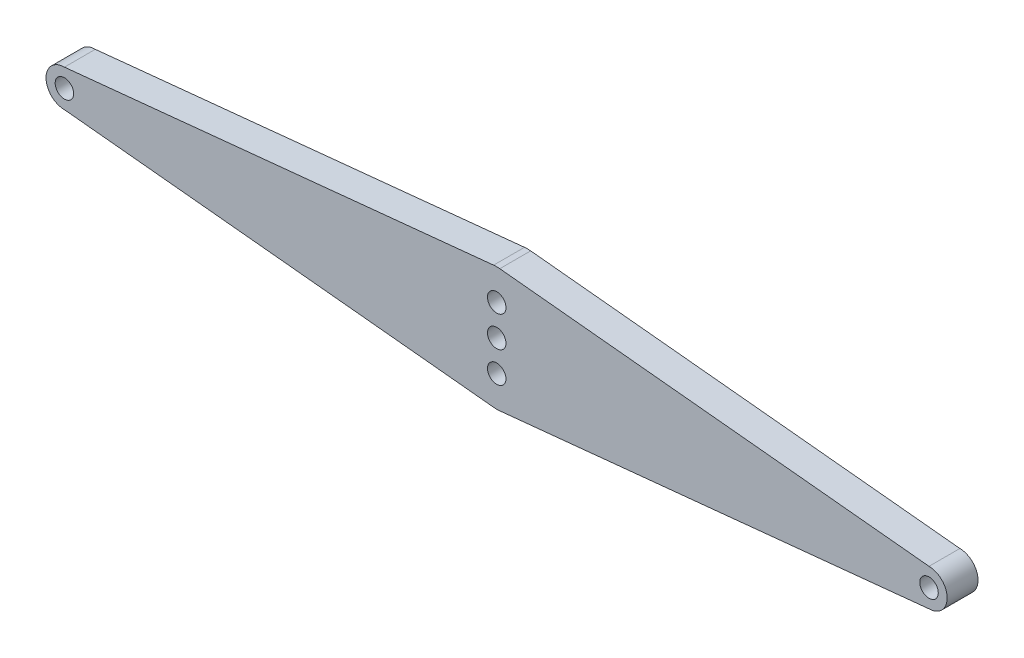
ISO-10303-21;
HEADER;
FILE_DESCRIPTION(('STEP AP214'),'2;1');
FILE_NAME('part.step','',(''),(''),'','','');
FILE_SCHEMA(('AUTOMOTIVE_DESIGN { 1 0 10303 214 1 1 1 1 }'));
ENDSEC;
DATA;
#1=APPLICATION_CONTEXT('core data for automotive mechanical design processes');
#2=APPLICATION_PROTOCOL_DEFINITION('international standard','automotive_design',2000,#1);
#3=PRODUCT_CONTEXT('',#1,'mechanical');
#4=PRODUCT('Part','Part','',(#3));
#5=PRODUCT_RELATED_PRODUCT_CATEGORY('part','',(#4));
#6=PRODUCT_DEFINITION_FORMATION('','',#4);
#7=PRODUCT_DEFINITION_CONTEXT('part definition',#1,'design');
#8=PRODUCT_DEFINITION('design','',#6,#7);
#9=PRODUCT_DEFINITION_SHAPE('','',#8);
#10=(LENGTH_UNIT() NAMED_UNIT(*) SI_UNIT(.MILLI.,.METRE.));
#11=(NAMED_UNIT(*) PLANE_ANGLE_UNIT() SI_UNIT($,.RADIAN.));
#12=(NAMED_UNIT(*) SI_UNIT($,.STERADIAN.) SOLID_ANGLE_UNIT());
#13=UNCERTAINTY_MEASURE_WITH_UNIT(LENGTH_MEASURE(1.E-05),#10,'distance_accuracy_value','');
#14=(GEOMETRIC_REPRESENTATION_CONTEXT(3) GLOBAL_UNCERTAINTY_ASSIGNED_CONTEXT((#13)) GLOBAL_UNIT_ASSIGNED_CONTEXT((#10,
#11,#12)) REPRESENTATION_CONTEXT('',''));
#15=CARTESIAN_POINT('',(0.,0.,0.));
#16=DIRECTION('',(0.,0.,1.));
#17=DIRECTION('',(1.,0.,0.));
#18=AXIS2_PLACEMENT_3D('',#15,#16,#17);
#19=CARTESIAN_POINT('',(0.199516414921997,-1.9849847617036,1.));
#20=DIRECTION('',(0.100008902661797,-0.994986542315213,0.));
#21=DIRECTION('',(0.994986542315213,0.100008902661797,0.));
#22=AXIS2_PLACEMENT_3D('',#19,#20,#21);
#23=PLANE('',#22);
#24=DIRECTION('',(-0.994986542315213,-0.100008902661797,0.));
#25=VECTOR('',#24,1.);
#26=CARTESIAN_POINT('',(0.199516414921997,-1.9849847617036,0.));
#27=LINE('',#26,#25);
#28=CARTESIAN_POINT('',(14.0067831952704,-0.597177449005422,0.));
#29=VERTEX_POINT('',#28);
#30=CARTESIAN_POINT('',(0.100008902661797,-1.99498654231521,0.));
#31=VERTEX_POINT('',#30);
#32=EDGE_CURVE('E146',#29,#31,#27,.T.);
#33=ORIENTED_EDGE('',*,*,#32,.F.);
#34=DIRECTION('',(0.,0.,-1.));
#35=VECTOR('',#34,1.);
#36=CARTESIAN_POINT('',(14.0067831952704,-0.597177449005422,1.));
#37=LINE('',#36,#35);
#38=CARTESIAN_POINT('',(14.0067831952704,-0.597177449005422,1.));
#39=VERTEX_POINT('',#38);
#40=EDGE_CURVE('E11',#39,#29,#37,.T.);
#41=ORIENTED_EDGE('',*,*,#40,.F.);
#42=DIRECTION('',(-0.994986542315213,-0.100008902661797,0.));
#43=VECTOR('',#42,1.);
#44=CARTESIAN_POINT('',(0.199516414921997,-1.9849847617036,1.));
#45=LINE('',#44,#43);
#46=CARTESIAN_POINT('',(0.100008902661797,-1.99498654231521,1.));
#47=VERTEX_POINT('',#46);
#48=EDGE_CURVE('E178',#39,#47,#45,.T.);
#49=ORIENTED_EDGE('',*,*,#48,.T.);
#50=DIRECTION('',(0.,0.,-1.));
#51=VECTOR('',#50,1.);
#52=CARTESIAN_POINT('',(0.100008902661797,-1.99498654231521,1.));
#53=LINE('',#52,#51);
#54=EDGE_CURVE('E89',#47,#31,#53,.T.);
#55=ORIENTED_EDGE('',*,*,#54,.T.);
#56=EDGE_LOOP('',(#33,#41,#49,#55));
#57=FACE_BOUND('',#56,.T.);
#58=ADVANCED_FACE('F38',(#57),#23,.T.);
#59=CARTESIAN_POINT('',(13.9979268814894,0.,1.));
#60=DIRECTION('',(0.,0.,-1.));
#61=DIRECTION('',(-1.,0.,0.));
#62=AXIS2_PLACEMENT_3D('',#59,#60,#61);
#63=CYLINDRICAL_SURFACE('',#62,0.597243116238617);
#64=CARTESIAN_POINT('',(13.9979268814894,0.,0.));
#65=DIRECTION('',(0.,0.,1.));
#66=DIRECTION('',(1.,0.,0.));
#67=AXIS2_PLACEMENT_3D('',#64,#65,#66);
#68=CIRCLE('',#67,0.597243116238617);
#69=CARTESIAN_POINT('',(14.0067831952704,0.597177449005422,0.));
#70=VERTEX_POINT('',#69);
#71=EDGE_CURVE('E149',#29,#70,#68,.T.);
#72=ORIENTED_EDGE('',*,*,#71,.T.);
#73=DIRECTION('',(0.,0.,-1.));
#74=VECTOR('',#73,1.);
#75=CARTESIAN_POINT('',(14.0067831952704,0.597177449005422,1.));
#76=LINE('',#75,#74);
#77=CARTESIAN_POINT('',(14.0067831952704,0.597177449005422,1.));
#78=VERTEX_POINT('',#77);
#79=EDGE_CURVE('E46',#78,#70,#76,.T.);
#80=ORIENTED_EDGE('',*,*,#79,.F.);
#81=CARTESIAN_POINT('',(13.9979268814894,0.,1.));
#82=DIRECTION('',(0.,0.,1.));
#83=DIRECTION('',(1.,0.,0.));
#84=AXIS2_PLACEMENT_3D('',#81,#82,#83);
#85=CIRCLE('',#84,0.597243116238617);
#86=EDGE_CURVE('E207',#39,#78,#85,.T.);
#87=ORIENTED_EDGE('',*,*,#86,.F.);
#88=ORIENTED_EDGE('',*,*,#40,.T.);
#89=EDGE_LOOP('',(#72,#80,#87,#88));
#90=FACE_BOUND('',#89,.T.);
#91=ADVANCED_FACE('F211',(#90),#63,.T.);
#92=CARTESIAN_POINT('',(0.199516414921997,1.9849847617036,1.));
#93=DIRECTION('',(-0.100008902661797,-0.994986542315213,0.));
#94=DIRECTION('',(0.994986542315213,-0.100008902661797,0.));
#95=AXIS2_PLACEMENT_3D('',#92,#93,#94);
#96=PLANE('',#95);
#97=DIRECTION('',(-0.994986542315213,0.100008902661797,0.));
#98=VECTOR('',#97,1.);
#99=CARTESIAN_POINT('',(0.199516414921997,1.9849847617036,0.));
#100=LINE('',#99,#98);
#101=CARTESIAN_POINT('',(0.100008902661797,1.99498654231521,0.));
#102=VERTEX_POINT('',#101);
#103=EDGE_CURVE('E151',#70,#102,#100,.T.);
#104=ORIENTED_EDGE('',*,*,#103,.T.);
#105=DIRECTION('',(0.,0.,-1.));
#106=VECTOR('',#105,1.);
#107=CARTESIAN_POINT('',(0.100008902661797,1.99498654231521,1.));
#108=LINE('',#107,#106);
#109=CARTESIAN_POINT('',(0.100008902661797,1.99498654231521,1.));
#110=VERTEX_POINT('',#109);
#111=EDGE_CURVE('E184',#110,#102,#108,.T.);
#112=ORIENTED_EDGE('',*,*,#111,.F.);
#113=DIRECTION('',(-0.994986542315213,0.100008902661797,0.));
#114=VECTOR('',#113,1.);
#115=CARTESIAN_POINT('',(0.199516414921997,1.9849847617036,1.));
#116=LINE('',#115,#114);
#117=EDGE_CURVE('E193',#78,#110,#116,.T.);
#118=ORIENTED_EDGE('',*,*,#117,.F.);
#119=ORIENTED_EDGE('',*,*,#79,.T.);
#120=EDGE_LOOP('',(#104,#112,#118,#119));
#121=FACE_BOUND('',#120,.T.);
#122=ADVANCED_FACE('F191',(#121),#96,.F.);
#123=CARTESIAN_POINT('',(0.,1.,1.));
#124=DIRECTION('',(0.,0.,-1.));
#125=DIRECTION('',(-1.,0.,0.));
#126=AXIS2_PLACEMENT_3D('',#123,#124,#125);
#127=CYLINDRICAL_SURFACE('',#126,1.);
#128=CARTESIAN_POINT('',(0.,1.,0.));
#129=DIRECTION('',(0.,0.,1.));
#130=DIRECTION('',(1.,0.,0.));
#131=AXIS2_PLACEMENT_3D('',#128,#129,#130);
#132=CIRCLE('',#131,1.);
#133=CARTESIAN_POINT('',(-0.100008902661797,1.99498654231521,0.));
#134=VERTEX_POINT('',#133);
#135=EDGE_CURVE('E153',#102,#134,#132,.T.);
#136=ORIENTED_EDGE('',*,*,#135,.T.);
#137=DIRECTION('',(0.,0.,-1.));
#138=VECTOR('',#137,1.);
#139=CARTESIAN_POINT('',(-0.100008902661797,1.99498654231521,1.));
#140=LINE('',#139,#138);
#141=CARTESIAN_POINT('',(-0.100008902661797,1.99498654231521,1.));
#142=VERTEX_POINT('',#141);
#143=EDGE_CURVE('E182',#142,#134,#140,.T.);
#144=ORIENTED_EDGE('',*,*,#143,.F.);
#145=CARTESIAN_POINT('',(0.,1.,1.));
#146=DIRECTION('',(0.,0.,1.));
#147=DIRECTION('',(1.,0.,0.));
#148=AXIS2_PLACEMENT_3D('',#145,#146,#147);
#149=CIRCLE('',#148,1.);
#150=EDGE_CURVE('E205',#110,#142,#149,.T.);
#151=ORIENTED_EDGE('',*,*,#150,.F.);
#152=ORIENTED_EDGE('',*,*,#111,.T.);
#153=EDGE_LOOP('',(#136,#144,#151,#152));
#154=FACE_BOUND('',#153,.T.);
#155=ADVANCED_FACE('F203',(#154),#127,.T.);
#156=CARTESIAN_POINT('',(-0.199516414921997,1.9849847617036,1.));
#157=DIRECTION('',(-0.100008902661797,0.994986542315213,0.));
#158=DIRECTION('',(-0.994986542315213,-0.100008902661797,0.));
#159=AXIS2_PLACEMENT_3D('',#156,#157,#158);
#160=PLANE('',#159);
#161=DIRECTION('',(0.994986542315213,0.100008902661797,0.));
#162=VECTOR('',#161,1.);
#163=CARTESIAN_POINT('',(-0.199516414921997,1.9849847617036,0.));
#164=LINE('',#163,#162);
#165=CARTESIAN_POINT('',(-14.0067831952704,0.597177449005419,0.));
#166=VERTEX_POINT('',#165);
#167=EDGE_CURVE('E156',#166,#134,#164,.T.);
#168=ORIENTED_EDGE('',*,*,#167,.F.);
#169=DIRECTION('',(0.,0.,-1.));
#170=VECTOR('',#169,1.);
#171=CARTESIAN_POINT('',(-14.0067831952704,0.597177449005419,1.));
#172=LINE('',#171,#170);
#173=CARTESIAN_POINT('',(-14.0067831952704,0.597177449005419,1.));
#174=VERTEX_POINT('',#173);
#175=EDGE_CURVE('E123',#174,#166,#172,.T.);
#176=ORIENTED_EDGE('',*,*,#175,.F.);
#177=DIRECTION('',(0.994986542315213,0.100008902661797,0.));
#178=VECTOR('',#177,1.);
#179=CARTESIAN_POINT('',(-0.199516414921997,1.9849847617036,1.));
#180=LINE('',#179,#178);
#181=EDGE_CURVE('E116',#174,#142,#180,.T.);
#182=ORIENTED_EDGE('',*,*,#181,.T.);
#183=ORIENTED_EDGE('',*,*,#143,.T.);
#184=EDGE_LOOP('',(#168,#176,#182,#183));
#185=FACE_BOUND('',#184,.T.);
#186=ADVANCED_FACE('F221',(#185),#160,.T.);
#187=CARTESIAN_POINT('',(-14.0067831952704,0.,1.));
#188=DIRECTION('',(0.,0.,-1.));
#189=DIRECTION('',(-1.,0.,0.));
#190=AXIS2_PLACEMENT_3D('',#187,#188,#189);
#191=CYLINDRICAL_SURFACE('',#190,0.597177449005419);
#192=CARTESIAN_POINT('',(-14.0067831952704,0.,0.));
#193=DIRECTION('',(0.,0.,1.));
#194=DIRECTION('',(1.,0.,0.));
#195=AXIS2_PLACEMENT_3D('',#192,#193,#194);
#196=CIRCLE('',#195,0.597177449005419);
#197=CARTESIAN_POINT('',(-14.0067831952704,-0.597177449005419,0.));
#198=VERTEX_POINT('',#197);
#199=EDGE_CURVE('E122',#166,#198,#196,.T.);
#200=ORIENTED_EDGE('',*,*,#199,.T.);
#201=DIRECTION('',(0.,0.,-1.));
#202=VECTOR('',#201,1.);
#203=CARTESIAN_POINT('',(-14.0067831952704,-0.597177449005419,1.));
#204=LINE('',#203,#202);
#205=CARTESIAN_POINT('',(-14.0067831952704,-0.597177449005419,1.));
#206=VERTEX_POINT('',#205);
#207=EDGE_CURVE('E119',#206,#198,#204,.T.);
#208=ORIENTED_EDGE('',*,*,#207,.F.);
#209=CARTESIAN_POINT('',(-14.0067831952704,0.,1.));
#210=DIRECTION('',(0.,0.,1.));
#211=DIRECTION('',(1.,0.,0.));
#212=AXIS2_PLACEMENT_3D('',#209,#210,#211);
#213=CIRCLE('',#212,0.597177449005419);
#214=EDGE_CURVE('E109',#174,#206,#213,.T.);
#215=ORIENTED_EDGE('',*,*,#214,.F.);
#216=ORIENTED_EDGE('',*,*,#175,.T.);
#217=EDGE_LOOP('',(#200,#208,#215,#216));
#218=FACE_BOUND('',#217,.T.);
#219=ADVANCED_FACE('F120',(#218),#191,.T.);
#220=CARTESIAN_POINT('',(-0.199516414921997,-1.9849847617036,1.));
#221=DIRECTION('',(0.100008902661797,0.994986542315213,0.));
#222=DIRECTION('',(-0.994986542315213,0.100008902661797,0.));
#223=AXIS2_PLACEMENT_3D('',#220,#221,#222);
#224=PLANE('',#223);
#225=DIRECTION('',(0.994986542315213,-0.100008902661797,0.));
#226=VECTOR('',#225,1.);
#227=CARTESIAN_POINT('',(-0.199516414921997,-1.9849847617036,0.));
#228=LINE('',#227,#226);
#229=CARTESIAN_POINT('',(-0.100008902661797,-1.99498654231521,0.));
#230=VERTEX_POINT('',#229);
#231=EDGE_CURVE('E82',#198,#230,#228,.T.);
#232=ORIENTED_EDGE('',*,*,#231,.T.);
#233=DIRECTION('',(0.,0.,-1.));
#234=VECTOR('',#233,1.);
#235=CARTESIAN_POINT('',(-0.100008902661797,-1.99498654231521,1.));
#236=LINE('',#235,#234);
#237=CARTESIAN_POINT('',(-0.100008902661797,-1.99498654231521,1.));
#238=VERTEX_POINT('',#237);
#239=EDGE_CURVE('E124',#238,#230,#236,.T.);
#240=ORIENTED_EDGE('',*,*,#239,.F.);
#241=DIRECTION('',(0.994986542315213,-0.100008902661797,0.));
#242=VECTOR('',#241,1.);
#243=CARTESIAN_POINT('',(-0.199516414921997,-1.9849847617036,1.));
#244=LINE('',#243,#242);
#245=EDGE_CURVE('E114',#206,#238,#244,.T.);
#246=ORIENTED_EDGE('',*,*,#245,.F.);
#247=ORIENTED_EDGE('',*,*,#207,.T.);
#248=EDGE_LOOP('',(#232,#240,#246,#247));
#249=FACE_BOUND('',#248,.T.);
#250=ADVANCED_FACE('F126',(#249),#224,.F.);
#251=CARTESIAN_POINT('',(0.,-1.,1.));
#252=DIRECTION('',(0.,0.,-1.));
#253=DIRECTION('',(-1.,0.,0.));
#254=AXIS2_PLACEMENT_3D('',#251,#252,#253);
#255=CYLINDRICAL_SURFACE('',#254,0.3);
#256=CARTESIAN_POINT('',(0.,-1.,1.));
#257=DIRECTION('',(0.,0.,1.));
#258=DIRECTION('',(1.,0.,0.));
#259=AXIS2_PLACEMENT_3D('',#256,#257,#258);
#260=CIRCLE('',#259,0.3);
#261=CARTESIAN_POINT('',(0.3,-1.,1.));
#262=VERTEX_POINT('',#261);
#263=EDGE_CURVE('E140',#262,#262,#260,.T.);
#264=ORIENTED_EDGE('',*,*,#263,.T.);
#265=EDGE_LOOP('',(#264));
#266=FACE_BOUND('',#265,.T.);
#267=CARTESIAN_POINT('',(0.,-1.,0.));
#268=DIRECTION('',(0.,0.,1.));
#269=DIRECTION('',(1.,0.,0.));
#270=AXIS2_PLACEMENT_3D('',#267,#268,#269);
#271=CIRCLE('',#270,0.3);
#272=CARTESIAN_POINT('',(0.3,-1.,0.));
#273=VERTEX_POINT('',#272);
#274=EDGE_CURVE('E172',#273,#273,#271,.T.);
#275=ORIENTED_EDGE('',*,*,#274,.F.);
#276=EDGE_LOOP('',(#275));
#277=FACE_BOUND('',#276,.T.);
#278=ADVANCED_FACE('F229',(#266,#277),#255,.F.);
#279=CARTESIAN_POINT('',(0.,1.,1.));
#280=DIRECTION('',(0.,0.,-1.));
#281=DIRECTION('',(-1.,0.,0.));
#282=AXIS2_PLACEMENT_3D('',#279,#280,#281);
#283=CYLINDRICAL_SURFACE('',#282,0.3);
#284=CARTESIAN_POINT('',(0.,1.,1.));
#285=DIRECTION('',(0.,0.,1.));
#286=DIRECTION('',(1.,0.,0.));
#287=AXIS2_PLACEMENT_3D('',#284,#285,#286);
#288=CIRCLE('',#287,0.3);
#289=CARTESIAN_POINT('',(0.3,1.,1.));
#290=VERTEX_POINT('',#289);
#291=EDGE_CURVE('E137',#290,#290,#288,.T.);
#292=ORIENTED_EDGE('',*,*,#291,.T.);
#293=EDGE_LOOP('',(#292));
#294=FACE_BOUND('',#293,.T.);
#295=CARTESIAN_POINT('',(0.,1.,0.));
#296=DIRECTION('',(0.,0.,1.));
#297=DIRECTION('',(1.,0.,0.));
#298=AXIS2_PLACEMENT_3D('',#295,#296,#297);
#299=CIRCLE('',#298,0.3);
#300=CARTESIAN_POINT('',(0.3,1.,0.));
#301=VERTEX_POINT('',#300);
#302=EDGE_CURVE('E169',#301,#301,#299,.T.);
#303=ORIENTED_EDGE('',*,*,#302,.F.);
#304=EDGE_LOOP('',(#303));
#305=FACE_BOUND('',#304,.T.);
#306=ADVANCED_FACE('F242',(#294,#305),#283,.F.);
#307=CARTESIAN_POINT('',(-14.0067831952704,0.,1.));
#308=DIRECTION('',(0.,0.,-1.));
#309=DIRECTION('',(-1.,0.,0.));
#310=AXIS2_PLACEMENT_3D('',#307,#308,#309);
#311=CYLINDRICAL_SURFACE('',#310,0.3);
#312=CARTESIAN_POINT('',(-14.0067831952704,0.,1.));
#313=DIRECTION('',(0.,0.,1.));
#314=DIRECTION('',(1.,0.,0.));
#315=AXIS2_PLACEMENT_3D('',#312,#313,#314);
#316=CIRCLE('',#315,0.3);
#317=CARTESIAN_POINT('',(-13.7067831952704,0.,1.));
#318=VERTEX_POINT('',#317);
#319=EDGE_CURVE('E134',#318,#318,#316,.T.);
#320=ORIENTED_EDGE('',*,*,#319,.T.);
#321=EDGE_LOOP('',(#320));
#322=FACE_BOUND('',#321,.T.);
#323=CARTESIAN_POINT('',(-14.0067831952704,0.,0.));
#324=DIRECTION('',(0.,0.,1.));
#325=DIRECTION('',(1.,0.,0.));
#326=AXIS2_PLACEMENT_3D('',#323,#324,#325);
#327=CIRCLE('',#326,0.3);
#328=CARTESIAN_POINT('',(-13.7067831952704,0.,0.));
#329=VERTEX_POINT('',#328);
#330=EDGE_CURVE('E166',#329,#329,#327,.T.);
#331=ORIENTED_EDGE('',*,*,#330,.F.);
#332=EDGE_LOOP('',(#331));
#333=FACE_BOUND('',#332,.T.);
#334=ADVANCED_FACE('F238',(#322,#333),#311,.F.);
#335=CARTESIAN_POINT('',(0.,0.,1.));
#336=DIRECTION('',(0.,0.,-1.));
#337=DIRECTION('',(-1.,0.,0.));
#338=AXIS2_PLACEMENT_3D('',#335,#336,#337);
#339=CYLINDRICAL_SURFACE('',#338,0.3);
#340=CARTESIAN_POINT('',(0.,0.,1.));
#341=DIRECTION('',(0.,0.,1.));
#342=DIRECTION('',(1.,0.,0.));
#343=AXIS2_PLACEMENT_3D('',#340,#341,#342);
#344=CIRCLE('',#343,0.3);
#345=CARTESIAN_POINT('',(0.3,0.,1.));
#346=VERTEX_POINT('',#345);
#347=EDGE_CURVE('E128',#346,#346,#344,.T.);
#348=ORIENTED_EDGE('',*,*,#347,.T.);
#349=EDGE_LOOP('',(#348));
#350=FACE_BOUND('',#349,.T.);
#351=CARTESIAN_POINT('',(0.,0.,0.));
#352=DIRECTION('',(0.,0.,1.));
#353=DIRECTION('',(1.,0.,0.));
#354=AXIS2_PLACEMENT_3D('',#351,#352,#353);
#355=CIRCLE('',#354,0.3);
#356=CARTESIAN_POINT('',(0.3,0.,0.));
#357=VERTEX_POINT('',#356);
#358=EDGE_CURVE('E163',#357,#357,#355,.T.);
#359=ORIENTED_EDGE('',*,*,#358,.F.);
#360=EDGE_LOOP('',(#359));
#361=FACE_BOUND('',#360,.T.);
#362=ADVANCED_FACE('F234',(#350,#361),#339,.F.);
#363=CARTESIAN_POINT('',(0.,-1.,1.));
#364=DIRECTION('',(0.,0.,-1.));
#365=DIRECTION('',(-1.,0.,0.));
#366=AXIS2_PLACEMENT_3D('',#363,#364,#365);
#367=CYLINDRICAL_SURFACE('',#366,1.);
#368=CARTESIAN_POINT('',(0.,-1.,0.));
#369=DIRECTION('',(0.,0.,1.));
#370=DIRECTION('',(1.,0.,0.));
#371=AXIS2_PLACEMENT_3D('',#368,#369,#370);
#372=CIRCLE('',#371,1.);
#373=EDGE_CURVE('E161',#230,#31,#372,.T.);
#374=ORIENTED_EDGE('',*,*,#373,.T.);
#375=ORIENTED_EDGE('',*,*,#54,.F.);
#376=CARTESIAN_POINT('',(0.,-1.,1.));
#377=DIRECTION('',(0.,0.,1.));
#378=DIRECTION('',(1.,0.,0.));
#379=AXIS2_PLACEMENT_3D('',#376,#377,#378);
#380=CIRCLE('',#379,1.);
#381=EDGE_CURVE('E54',#238,#47,#380,.T.);
#382=ORIENTED_EDGE('',*,*,#381,.F.);
#383=ORIENTED_EDGE('',*,*,#239,.T.);
#384=EDGE_LOOP('',(#374,#375,#382,#383));
#385=FACE_BOUND('',#384,.T.);
#386=ADVANCED_FACE('F230',(#385),#367,.T.);
#387=CARTESIAN_POINT('',(14.0067831952704,0.,1.));
#388=DIRECTION('',(0.,0.,-1.));
#389=DIRECTION('',(-1.,0.,0.));
#390=AXIS2_PLACEMENT_3D('',#387,#388,#389);
#391=CYLINDRICAL_SURFACE('',#390,0.3);
#392=CARTESIAN_POINT('',(14.0067831952704,0.,1.));
#393=DIRECTION('',(0.,0.,1.));
#394=DIRECTION('',(1.,0.,0.));
#395=AXIS2_PLACEMENT_3D('',#392,#393,#394);
#396=CIRCLE('',#395,0.3);
#397=CARTESIAN_POINT('',(14.3067831952704,0.,1.));
#398=VERTEX_POINT('',#397);
#399=EDGE_CURVE('E143',#398,#398,#396,.T.);
#400=ORIENTED_EDGE('',*,*,#399,.T.);
#401=EDGE_LOOP('',(#400));
#402=FACE_BOUND('',#401,.T.);
#403=CARTESIAN_POINT('',(14.0067831952704,0.,0.));
#404=DIRECTION('',(0.,0.,1.));
#405=DIRECTION('',(1.,0.,0.));
#406=AXIS2_PLACEMENT_3D('',#403,#404,#405);
#407=CIRCLE('',#406,0.3);
#408=CARTESIAN_POINT('',(14.3067831952704,0.,0.));
#409=VERTEX_POINT('',#408);
#410=EDGE_CURVE('E175',#409,#409,#407,.T.);
#411=ORIENTED_EDGE('',*,*,#410,.F.);
#412=EDGE_LOOP('',(#411));
#413=FACE_BOUND('',#412,.T.);
#414=ADVANCED_FACE('F233',(#402,#413),#391,.F.);
#415=CARTESIAN_POINT('',(0.,0.,1.));
#416=DIRECTION('',(0.,0.,1.));
#417=DIRECTION('',(1.,0.,0.));
#418=AXIS2_PLACEMENT_3D('',#415,#416,#417);
#419=PLANE('',#418);
#420=ORIENTED_EDGE('',*,*,#48,.F.);
#421=ORIENTED_EDGE('',*,*,#86,.T.);
#422=ORIENTED_EDGE('',*,*,#117,.T.);
#423=ORIENTED_EDGE('',*,*,#150,.T.);
#424=ORIENTED_EDGE('',*,*,#181,.F.);
#425=ORIENTED_EDGE('',*,*,#214,.T.);
#426=ORIENTED_EDGE('',*,*,#245,.T.);
#427=ORIENTED_EDGE('',*,*,#381,.T.);
#428=EDGE_LOOP('',(#420,#421,#422,#423,#424,#425,#426,#427));
#429=FACE_BOUND('',#428,.T.);
#430=ORIENTED_EDGE('',*,*,#347,.F.);
#431=EDGE_LOOP('',(#430));
#432=FACE_BOUND('',#431,.T.);
#433=ORIENTED_EDGE('',*,*,#319,.F.);
#434=EDGE_LOOP('',(#433));
#435=FACE_BOUND('',#434,.T.);
#436=ORIENTED_EDGE('',*,*,#291,.F.);
#437=EDGE_LOOP('',(#436));
#438=FACE_BOUND('',#437,.T.);
#439=ORIENTED_EDGE('',*,*,#263,.F.);
#440=EDGE_LOOP('',(#439));
#441=FACE_BOUND('',#440,.T.);
#442=ORIENTED_EDGE('',*,*,#399,.F.);
#443=EDGE_LOOP('',(#442));
#444=FACE_BOUND('',#443,.T.);
#445=ADVANCED_FACE('F111',(#429,#432,#435,#438,#441,#444),#419,.T.);
#446=CARTESIAN_POINT('',(0.,0.,0.));
#447=DIRECTION('',(0.,0.,1.));
#448=DIRECTION('',(1.,0.,0.));
#449=AXIS2_PLACEMENT_3D('',#446,#447,#448);
#450=PLANE('',#449);
#451=ORIENTED_EDGE('',*,*,#32,.T.);
#452=ORIENTED_EDGE('',*,*,#373,.F.);
#453=ORIENTED_EDGE('',*,*,#231,.F.);
#454=ORIENTED_EDGE('',*,*,#199,.F.);
#455=ORIENTED_EDGE('',*,*,#167,.T.);
#456=ORIENTED_EDGE('',*,*,#135,.F.);
#457=ORIENTED_EDGE('',*,*,#103,.F.);
#458=ORIENTED_EDGE('',*,*,#71,.F.);
#459=EDGE_LOOP('',(#451,#452,#453,#454,#455,#456,#457,#458));
#460=FACE_BOUND('',#459,.T.);
#461=ORIENTED_EDGE('',*,*,#358,.T.);
#462=EDGE_LOOP('',(#461));
#463=FACE_BOUND('',#462,.T.);
#464=ORIENTED_EDGE('',*,*,#330,.T.);
#465=EDGE_LOOP('',(#464));
#466=FACE_BOUND('',#465,.T.);
#467=ORIENTED_EDGE('',*,*,#302,.T.);
#468=EDGE_LOOP('',(#467));
#469=FACE_BOUND('',#468,.T.);
#470=ORIENTED_EDGE('',*,*,#274,.T.);
#471=EDGE_LOOP('',(#470));
#472=FACE_BOUND('',#471,.T.);
#473=ORIENTED_EDGE('',*,*,#410,.T.);
#474=EDGE_LOOP('',(#473));
#475=FACE_BOUND('',#474,.T.);
#476=ADVANCED_FACE('F198',(#460,#463,#466,#469,#472,#475),#450,.F.);
#477=CLOSED_SHELL('',(#58,#91,#122,#155,#186,#219,#250,#278,#306,#334,#362,#386,#414,#445,#476));
#478=MANIFOLD_SOLID_BREP('B2',#477);
#479=ADVANCED_BREP_SHAPE_REPRESENTATION('',(#18,#478),#14);
#480=SHAPE_DEFINITION_REPRESENTATION(#9,#479);
ENDSEC;
END-ISO-10303-21;
